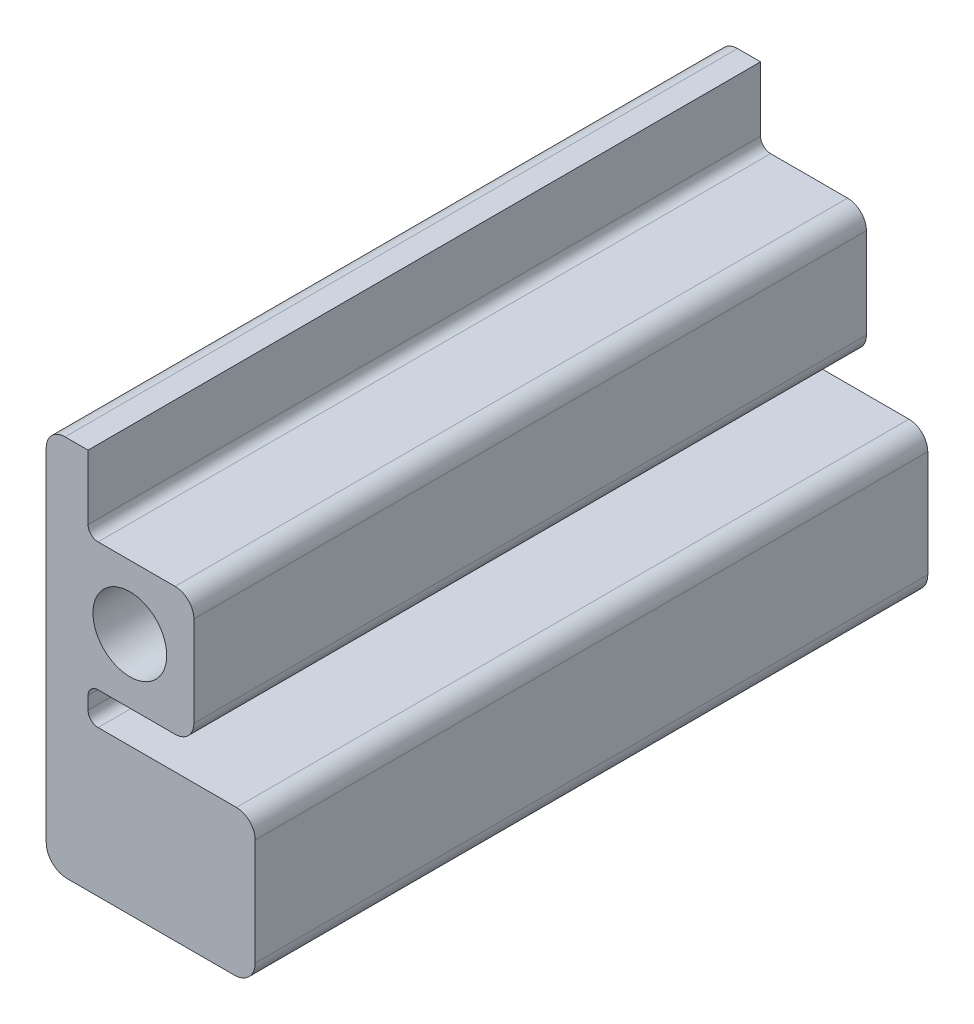
ISO-10303-21;
HEADER;
FILE_DESCRIPTION(('STEP AP214'),'2;1');
FILE_NAME('part.step','',(''),(''),'','','');
FILE_SCHEMA(('AUTOMOTIVE_DESIGN { 1 0 10303 214 1 1 1 1 }'));
ENDSEC;
DATA;
#1=APPLICATION_CONTEXT('core data for automotive mechanical design processes');
#2=APPLICATION_PROTOCOL_DEFINITION('international standard','automotive_design',2000,#1);
#3=PRODUCT_CONTEXT('',#1,'mechanical');
#4=PRODUCT('Part','Part','',(#3));
#5=PRODUCT_RELATED_PRODUCT_CATEGORY('part','',(#4));
#6=PRODUCT_DEFINITION_FORMATION('','',#4);
#7=PRODUCT_DEFINITION_CONTEXT('part definition',#1,'design');
#8=PRODUCT_DEFINITION('design','',#6,#7);
#9=PRODUCT_DEFINITION_SHAPE('','',#8);
#10=(LENGTH_UNIT() NAMED_UNIT(*) SI_UNIT(.MILLI.,.METRE.));
#11=(NAMED_UNIT(*) PLANE_ANGLE_UNIT() SI_UNIT($,.RADIAN.));
#12=(NAMED_UNIT(*) SI_UNIT($,.STERADIAN.) SOLID_ANGLE_UNIT());
#13=UNCERTAINTY_MEASURE_WITH_UNIT(LENGTH_MEASURE(1.E-05),#10,'distance_accuracy_value','');
#14=(GEOMETRIC_REPRESENTATION_CONTEXT(3) GLOBAL_UNCERTAINTY_ASSIGNED_CONTEXT((#13)) GLOBAL_UNIT_ASSIGNED_CONTEXT((#10,
#11,#12)) REPRESENTATION_CONTEXT('',''));
#15=CARTESIAN_POINT('',(0.,0.,0.));
#16=DIRECTION('',(0.,0.,1.));
#17=DIRECTION('',(1.,0.,0.));
#18=AXIS2_PLACEMENT_3D('',#15,#16,#17);
#19=CARTESIAN_POINT('',(-9.65199999999999,-22.503,204.313708212));
#20=DIRECTION('',(0.,0.,-1.));
#21=DIRECTION('',(-1.,0.,0.));
#22=AXIS2_PLACEMENT_3D('',#19,#20,#21);
#23=PLANE('',#22);
#24=CARTESIAN_POINT('',(0.,0.,204.313708212));
#25=DIRECTION('',(0.,0.,1.));
#26=DIRECTION('',(1.,0.,0.));
#27=AXIS2_PLACEMENT_3D('',#24,#25,#26);
#28=CIRCLE('',#27,11.2);
#29=CARTESIAN_POINT('',(11.2,0.,204.313708212));
#30=VERTEX_POINT('',#29);
#31=EDGE_CURVE('E220',#30,#30,#28,.T.);
#32=ORIENTED_EDGE('',*,*,#31,.F.);
#33=EDGE_LOOP('',(#32));
#34=FACE_BOUND('',#33,.T.);
#35=DIRECTION('',(0.,1.,0.));
#36=VECTOR('',#35,1.);
#37=CARTESIAN_POINT('',(-12.7,22.503,204.313708212));
#38=LINE('',#37,#36);
#39=CARTESIAN_POINT('',(-12.7,22.503,204.313708212));
#40=VERTEX_POINT('',#39);
#41=CARTESIAN_POINT('',(-12.7,42.08,204.313708212));
#42=VERTEX_POINT('',#41);
#43=EDGE_CURVE('E320',#40,#42,#38,.T.);
#44=ORIENTED_EDGE('',*,*,#43,.T.);
#45=DIRECTION('',(-1.,0.,0.));
#46=VECTOR('',#45,1.);
#47=CARTESIAN_POINT('',(32.385,42.08,204.313708212));
#48=LINE('',#47,#46);
#49=CARTESIAN_POINT('',(-19.685,42.08,204.313708212));
#50=VERTEX_POINT('',#49);
#51=EDGE_CURVE('E322',#42,#50,#48,.T.);
#52=ORIENTED_EDGE('',*,*,#51,.T.);
#53=CARTESIAN_POINT('',(-19.685,36.365,204.313708212));
#54=DIRECTION('',(0.,0.,1.));
#55=DIRECTION('',(1.,0.,0.));
#56=AXIS2_PLACEMENT_3D('',#53,#54,#55);
#57=CIRCLE('',#56,5.71499999999999);
#58=CARTESIAN_POINT('',(-25.4,36.365,204.313708212));
#59=VERTEX_POINT('',#58);
#60=EDGE_CURVE('E324',#50,#59,#57,.T.);
#61=ORIENTED_EDGE('',*,*,#60,.T.);
#62=DIRECTION('',(0.,-1.,0.));
#63=VECTOR('',#62,1.);
#64=CARTESIAN_POINT('',(-25.4,-67.479999962,204.313708212));
#65=LINE('',#64,#63);
#66=CARTESIAN_POINT('',(-25.4,-67.479999962,204.313708212));
#67=VERTEX_POINT('',#66);
#68=EDGE_CURVE('E326',#59,#67,#65,.T.);
#69=ORIENTED_EDGE('',*,*,#68,.T.);
#70=CARTESIAN_POINT('',(-19.05,-67.479999962,204.313708212));
#71=DIRECTION('',(0.,0.,1.));
#72=DIRECTION('',(-1.,0.,0.));
#73=AXIS2_PLACEMENT_3D('',#70,#71,#72);
#74=CIRCLE('',#73,6.35);
#75=CARTESIAN_POINT('',(-19.05,-73.829999962,204.313708212));
#76=VERTEX_POINT('',#75);
#77=EDGE_CURVE('E328',#67,#76,#74,.T.);
#78=ORIENTED_EDGE('',*,*,#77,.T.);
#79=DIRECTION('',(1.,0.,0.));
#80=VECTOR('',#79,1.);
#81=CARTESIAN_POINT('',(31.75,-73.829999962,204.313708212));
#82=LINE('',#81,#80);
#83=CARTESIAN_POINT('',(31.75,-73.829999962,204.313708212));
#84=VERTEX_POINT('',#83);
#85=EDGE_CURVE('E330',#76,#84,#82,.T.);
#86=ORIENTED_EDGE('',*,*,#85,.T.);
#87=CARTESIAN_POINT('',(31.75,-67.479999962,204.313708212));
#88=DIRECTION('',(0.,0.,1.));
#89=DIRECTION('',(1.,0.,0.));
#90=AXIS2_PLACEMENT_3D('',#87,#88,#89);
#91=CIRCLE('',#90,6.35);
#92=CARTESIAN_POINT('',(38.1,-67.479999962,204.313708212));
#93=VERTEX_POINT('',#92);
#94=EDGE_CURVE('E332',#84,#93,#91,.T.);
#95=ORIENTED_EDGE('',*,*,#94,.T.);
#96=DIRECTION('',(0.,1.,0.));
#97=VECTOR('',#96,1.);
#98=CARTESIAN_POINT('',(38.1,-67.479999962,204.313708212));
#99=LINE('',#98,#97);
#100=CARTESIAN_POINT('',(38.1,-35.094999962,204.313708212));
#101=VERTEX_POINT('',#100);
#102=EDGE_CURVE('E334',#93,#101,#99,.T.);
#103=ORIENTED_EDGE('',*,*,#102,.T.);
#104=CARTESIAN_POINT('',(32.385,-35.094999962,204.313708212));
#105=DIRECTION('',(0.,0.,1.));
#106=DIRECTION('',(1.,0.,0.));
#107=AXIS2_PLACEMENT_3D('',#104,#105,#106);
#108=CIRCLE('',#107,5.71499999999999);
#109=CARTESIAN_POINT('',(32.385,-29.379999962,204.313708212));
#110=VERTEX_POINT('',#109);
#111=EDGE_CURVE('E336',#101,#110,#108,.T.);
#112=ORIENTED_EDGE('',*,*,#111,.T.);
#113=DIRECTION('',(-1.,0.,0.));
#114=VECTOR('',#113,1.);
#115=CARTESIAN_POINT('',(32.385,-29.379999962,204.313708212));
#116=LINE('',#115,#114);
#117=CARTESIAN_POINT('',(-9.65199999999999,-29.379999962,204.313708212));
#118=VERTEX_POINT('',#117);
#119=EDGE_CURVE('E193',#110,#118,#116,.T.);
#120=ORIENTED_EDGE('',*,*,#119,.T.);
#121=CARTESIAN_POINT('',(-9.65199999999999,-26.331999962,204.313708212));
#122=DIRECTION('',(0.,0.,-1.));
#123=DIRECTION('',(-1.,0.,0.));
#124=AXIS2_PLACEMENT_3D('',#121,#122,#123);
#125=CIRCLE('',#124,3.048);
#126=CARTESIAN_POINT('',(-12.7,-26.331999962,204.313708212));
#127=VERTEX_POINT('',#126);
#128=EDGE_CURVE('E186',#118,#127,#125,.T.);
#129=ORIENTED_EDGE('',*,*,#128,.T.);
#130=DIRECTION('',(0.,1.,0.));
#131=VECTOR('',#130,1.);
#132=CARTESIAN_POINT('',(-12.7,-26.331999962,204.313708212));
#133=LINE('',#132,#131);
#134=CARTESIAN_POINT('',(-12.7,-22.503,204.313708212));
#135=VERTEX_POINT('',#134);
#136=EDGE_CURVE('E190',#127,#135,#133,.T.);
#137=ORIENTED_EDGE('',*,*,#136,.T.);
#138=CARTESIAN_POINT('',(-9.65199999999999,-22.503,204.313708212));
#139=DIRECTION('',(0.,0.,-1.));
#140=DIRECTION('',(-1.,0.,0.));
#141=AXIS2_PLACEMENT_3D('',#138,#139,#140);
#142=CIRCLE('',#141,3.048);
#143=CARTESIAN_POINT('',(-9.65199999999999,-19.455,204.313708212));
#144=VERTEX_POINT('',#143);
#145=EDGE_CURVE('E210',#135,#144,#142,.T.);
#146=ORIENTED_EDGE('',*,*,#145,.T.);
#147=DIRECTION('',(1.,0.,0.));
#148=VECTOR('',#147,1.);
#149=CARTESIAN_POINT('',(13.74,-19.455,204.313708212));
#150=LINE('',#149,#148);
#151=CARTESIAN_POINT('',(13.74,-19.455,204.313708212));
#152=VERTEX_POINT('',#151);
#153=EDGE_CURVE('E68',#144,#152,#150,.T.);
#154=ORIENTED_EDGE('',*,*,#153,.T.);
#155=CARTESIAN_POINT('',(13.74,-13.74,204.313708212));
#156=DIRECTION('',(0.,0.,1.));
#157=DIRECTION('',(-1.,0.,0.));
#158=AXIS2_PLACEMENT_3D('',#155,#156,#157);
#159=CIRCLE('',#158,5.715);
#160=CARTESIAN_POINT('',(19.455,-13.74,204.313708212));
#161=VERTEX_POINT('',#160);
#162=EDGE_CURVE('E141',#152,#161,#159,.T.);
#163=ORIENTED_EDGE('',*,*,#162,.T.);
#164=DIRECTION('',(0.,1.,0.));
#165=VECTOR('',#164,1.);
#166=CARTESIAN_POINT('',(19.455,0.,204.313708212));
#167=LINE('',#166,#165);
#168=CARTESIAN_POINT('',(19.455,13.74,204.313708212));
#169=VERTEX_POINT('',#168);
#170=EDGE_CURVE('E312',#161,#169,#167,.T.);
#171=ORIENTED_EDGE('',*,*,#170,.T.);
#172=CARTESIAN_POINT('',(13.74,13.74,204.313708212));
#173=DIRECTION('',(0.,0.,1.));
#174=DIRECTION('',(-1.,0.,0.));
#175=AXIS2_PLACEMENT_3D('',#172,#173,#174);
#176=CIRCLE('',#175,5.715);
#177=CARTESIAN_POINT('',(13.74,19.455,204.313708212));
#178=VERTEX_POINT('',#177);
#179=EDGE_CURVE('E309',#169,#178,#176,.T.);
#180=ORIENTED_EDGE('',*,*,#179,.T.);
#181=DIRECTION('',(-1.,0.,0.));
#182=VECTOR('',#181,1.);
#183=CARTESIAN_POINT('',(0.,19.455,204.313708212));
#184=LINE('',#183,#182);
#185=CARTESIAN_POINT('',(-9.65199999999999,19.455,204.313708212));
#186=VERTEX_POINT('',#185);
#187=EDGE_CURVE('E311',#178,#186,#184,.T.);
#188=ORIENTED_EDGE('',*,*,#187,.T.);
#189=CARTESIAN_POINT('',(-9.65199999999999,22.503,204.313708212));
#190=DIRECTION('',(0.,0.,-1.));
#191=DIRECTION('',(-1.,0.,0.));
#192=AXIS2_PLACEMENT_3D('',#189,#190,#191);
#193=CIRCLE('',#192,3.048);
#194=EDGE_CURVE('E314',#186,#40,#193,.T.);
#195=ORIENTED_EDGE('',*,*,#194,.T.);
#196=EDGE_LOOP('',(#44,#52,#61,#69,#78,#86,#95,#103,#112,#120,#129,#137,#146,#154,#163,#171,
#180,#188,#195));
#197=FACE_BOUND('',#196,.T.);
#198=ADVANCED_FACE('F45',(#34,#197),#23,.F.);
#199=CARTESIAN_POINT('',(-9.65199999999999,-22.503,0.));
#200=DIRECTION('',(0.,0.,-1.));
#201=DIRECTION('',(-1.,0.,0.));
#202=AXIS2_PLACEMENT_3D('',#199,#200,#201);
#203=PLANE('',#202);
#204=CARTESIAN_POINT('',(0.,0.,0.));
#205=DIRECTION('',(0.,0.,1.));
#206=DIRECTION('',(1.,0.,0.));
#207=AXIS2_PLACEMENT_3D('',#204,#205,#206);
#208=CIRCLE('',#207,11.2);
#209=CARTESIAN_POINT('',(11.2,0.,0.));
#210=VERTEX_POINT('',#209);
#211=EDGE_CURVE('E350',#210,#210,#208,.T.);
#212=ORIENTED_EDGE('',*,*,#211,.T.);
#213=EDGE_LOOP('',(#212));
#214=FACE_BOUND('',#213,.T.);
#215=DIRECTION('',(-1.,0.,0.));
#216=VECTOR('',#215,1.);
#217=CARTESIAN_POINT('',(32.385,42.08,0.));
#218=LINE('',#217,#216);
#219=CARTESIAN_POINT('',(-12.7,42.08,0.));
#220=VERTEX_POINT('',#219);
#221=CARTESIAN_POINT('',(-19.685,42.08,0.));
#222=VERTEX_POINT('',#221);
#223=EDGE_CURVE('E230',#220,#222,#218,.T.);
#224=ORIENTED_EDGE('',*,*,#223,.F.);
#225=DIRECTION('',(0.,1.,0.));
#226=VECTOR('',#225,1.);
#227=CARTESIAN_POINT('',(-12.7,22.503,0.));
#228=LINE('',#227,#226);
#229=CARTESIAN_POINT('',(-12.7,22.503,0.));
#230=VERTEX_POINT('',#229);
#231=EDGE_CURVE('E59',#230,#220,#228,.T.);
#232=ORIENTED_EDGE('',*,*,#231,.F.);
#233=CARTESIAN_POINT('',(-9.65199999999999,22.503,0.));
#234=DIRECTION('',(0.,0.,-1.));
#235=DIRECTION('',(-1.,0.,0.));
#236=AXIS2_PLACEMENT_3D('',#233,#234,#235);
#237=CIRCLE('',#236,3.048);
#238=CARTESIAN_POINT('',(-9.65199999999999,19.455,0.));
#239=VERTEX_POINT('',#238);
#240=EDGE_CURVE('E227',#239,#230,#237,.T.);
#241=ORIENTED_EDGE('',*,*,#240,.F.);
#242=DIRECTION('',(-1.,0.,0.));
#243=VECTOR('',#242,1.);
#244=CARTESIAN_POINT('',(-9.65199999999999,19.455,0.));
#245=LINE('',#244,#243);
#246=CARTESIAN_POINT('',(13.74,19.455,0.));
#247=VERTEX_POINT('',#246);
#248=EDGE_CURVE('E225',#247,#239,#245,.T.);
#249=ORIENTED_EDGE('',*,*,#248,.F.);
#250=CARTESIAN_POINT('',(13.74,13.74,0.));
#251=DIRECTION('',(0.,0.,1.));
#252=DIRECTION('',(-1.,0.,0.));
#253=AXIS2_PLACEMENT_3D('',#250,#251,#252);
#254=CIRCLE('',#253,5.715);
#255=CARTESIAN_POINT('',(19.455,13.74,0.));
#256=VERTEX_POINT('',#255);
#257=EDGE_CURVE('E222',#256,#247,#254,.T.);
#258=ORIENTED_EDGE('',*,*,#257,.F.);
#259=DIRECTION('',(0.,1.,0.));
#260=VECTOR('',#259,1.);
#261=CARTESIAN_POINT('',(19.455,13.74,0.));
#262=LINE('',#261,#260);
#263=CARTESIAN_POINT('',(19.455,-13.74,0.));
#264=VERTEX_POINT('',#263);
#265=EDGE_CURVE('E219',#264,#256,#262,.T.);
#266=ORIENTED_EDGE('',*,*,#265,.F.);
#267=CARTESIAN_POINT('',(13.74,-13.74,0.));
#268=DIRECTION('',(0.,0.,1.));
#269=DIRECTION('',(-1.,0.,0.));
#270=AXIS2_PLACEMENT_3D('',#267,#268,#269);
#271=CIRCLE('',#270,5.715);
#272=CARTESIAN_POINT('',(13.74,-19.455,0.));
#273=VERTEX_POINT('',#272);
#274=EDGE_CURVE('E216',#273,#264,#271,.T.);
#275=ORIENTED_EDGE('',*,*,#274,.F.);
#276=DIRECTION('',(1.,0.,0.));
#277=VECTOR('',#276,1.);
#278=CARTESIAN_POINT('',(-9.65199999999999,-19.455,0.));
#279=LINE('',#278,#277);
#280=CARTESIAN_POINT('',(-9.65199999999999,-19.455,0.));
#281=VERTEX_POINT('',#280);
#282=EDGE_CURVE('E252',#281,#273,#279,.T.);
#283=ORIENTED_EDGE('',*,*,#282,.F.);
#284=CARTESIAN_POINT('',(-9.65199999999999,-22.503,0.));
#285=DIRECTION('',(0.,0.,-1.));
#286=DIRECTION('',(-1.,0.,0.));
#287=AXIS2_PLACEMENT_3D('',#284,#285,#286);
#288=CIRCLE('',#287,3.048);
#289=CARTESIAN_POINT('',(-12.7,-22.503,0.));
#290=VERTEX_POINT('',#289);
#291=EDGE_CURVE('E133',#290,#281,#288,.T.);
#292=ORIENTED_EDGE('',*,*,#291,.F.);
#293=DIRECTION('',(0.,1.,0.));
#294=VECTOR('',#293,1.);
#295=CARTESIAN_POINT('',(-12.7,-26.331999962,0.));
#296=LINE('',#295,#294);
#297=CARTESIAN_POINT('',(-12.7,-26.331999962,0.));
#298=VERTEX_POINT('',#297);
#299=EDGE_CURVE('E249',#298,#290,#296,.T.);
#300=ORIENTED_EDGE('',*,*,#299,.F.);
#301=CARTESIAN_POINT('',(-9.65199999999999,-26.331999962,0.));
#302=DIRECTION('',(0.,0.,-1.));
#303=DIRECTION('',(-1.,0.,0.));
#304=AXIS2_PLACEMENT_3D('',#301,#302,#303);
#305=CIRCLE('',#304,3.048);
#306=CARTESIAN_POINT('',(-9.65199999999999,-29.379999962,0.));
#307=VERTEX_POINT('',#306);
#308=EDGE_CURVE('E202',#307,#298,#305,.T.);
#309=ORIENTED_EDGE('',*,*,#308,.F.);
#310=DIRECTION('',(-1.,0.,0.));
#311=VECTOR('',#310,1.);
#312=CARTESIAN_POINT('',(32.385,-29.379999962,0.));
#313=LINE('',#312,#311);
#314=CARTESIAN_POINT('',(32.385,-29.379999962,0.));
#315=VERTEX_POINT('',#314);
#316=EDGE_CURVE('E246',#315,#307,#313,.T.);
#317=ORIENTED_EDGE('',*,*,#316,.F.);
#318=CARTESIAN_POINT('',(32.385,-35.094999962,0.));
#319=DIRECTION('',(0.,0.,1.));
#320=DIRECTION('',(1.,0.,0.));
#321=AXIS2_PLACEMENT_3D('',#318,#319,#320);
#322=CIRCLE('',#321,5.71499999999999);
#323=CARTESIAN_POINT('',(38.1,-35.094999962,0.));
#324=VERTEX_POINT('',#323);
#325=EDGE_CURVE('E244',#324,#315,#322,.T.);
#326=ORIENTED_EDGE('',*,*,#325,.F.);
#327=DIRECTION('',(0.,1.,0.));
#328=VECTOR('',#327,1.);
#329=CARTESIAN_POINT('',(38.1,-67.479999962,0.));
#330=LINE('',#329,#328);
#331=CARTESIAN_POINT('',(38.1,-67.479999962,0.));
#332=VERTEX_POINT('',#331);
#333=EDGE_CURVE('E242',#332,#324,#330,.T.);
#334=ORIENTED_EDGE('',*,*,#333,.F.);
#335=CARTESIAN_POINT('',(31.75,-67.479999962,0.));
#336=DIRECTION('',(0.,0.,1.));
#337=DIRECTION('',(1.,0.,0.));
#338=AXIS2_PLACEMENT_3D('',#335,#336,#337);
#339=CIRCLE('',#338,6.35);
#340=CARTESIAN_POINT('',(31.75,-73.829999962,0.));
#341=VERTEX_POINT('',#340);
#342=EDGE_CURVE('E240',#341,#332,#339,.T.);
#343=ORIENTED_EDGE('',*,*,#342,.F.);
#344=DIRECTION('',(1.,0.,0.));
#345=VECTOR('',#344,1.);
#346=CARTESIAN_POINT('',(31.75,-73.829999962,0.));
#347=LINE('',#346,#345);
#348=CARTESIAN_POINT('',(-19.05,-73.829999962,0.));
#349=VERTEX_POINT('',#348);
#350=EDGE_CURVE('E238',#349,#341,#347,.T.);
#351=ORIENTED_EDGE('',*,*,#350,.F.);
#352=CARTESIAN_POINT('',(-19.05,-67.479999962,0.));
#353=DIRECTION('',(0.,0.,1.));
#354=DIRECTION('',(-1.,0.,0.));
#355=AXIS2_PLACEMENT_3D('',#352,#353,#354);
#356=CIRCLE('',#355,6.35);
#357=CARTESIAN_POINT('',(-25.4,-67.479999962,0.));
#358=VERTEX_POINT('',#357);
#359=EDGE_CURVE('E236',#358,#349,#356,.T.);
#360=ORIENTED_EDGE('',*,*,#359,.F.);
#361=DIRECTION('',(0.,-1.,0.));
#362=VECTOR('',#361,1.);
#363=CARTESIAN_POINT('',(-25.4,-67.479999962,0.));
#364=LINE('',#363,#362);
#365=CARTESIAN_POINT('',(-25.4,36.365,0.));
#366=VERTEX_POINT('',#365);
#367=EDGE_CURVE('E234',#366,#358,#364,.T.);
#368=ORIENTED_EDGE('',*,*,#367,.F.);
#369=CARTESIAN_POINT('',(-19.685,36.365,0.));
#370=DIRECTION('',(0.,0.,1.));
#371=DIRECTION('',(1.,0.,0.));
#372=AXIS2_PLACEMENT_3D('',#369,#370,#371);
#373=CIRCLE('',#372,5.71499999999999);
#374=EDGE_CURVE('E232',#222,#366,#373,.T.);
#375=ORIENTED_EDGE('',*,*,#374,.F.);
#376=EDGE_LOOP('',(#224,#232,#241,#249,#258,#266,#275,#283,#292,#300,#309,#317,#326,#334,#343,
#351,#360,#368,#375));
#377=FACE_BOUND('',#376,.T.);
#378=ADVANCED_FACE('F299',(#214,#377),#203,.T.);
#379=CARTESIAN_POINT('',(32.385,42.08,204.313708212));
#380=DIRECTION('',(0.,-1.,0.));
#381=DIRECTION('',(1.,0.,0.));
#382=AXIS2_PLACEMENT_3D('',#379,#380,#381);
#383=PLANE('',#382);
#384=DIRECTION('',(0.,0.,1.));
#385=VECTOR('',#384,1.);
#386=CARTESIAN_POINT('',(-12.7,42.08,204.313708212));
#387=LINE('',#386,#385);
#388=EDGE_CURVE('E11',#220,#42,#387,.T.);
#389=ORIENTED_EDGE('',*,*,#388,.F.);
#390=ORIENTED_EDGE('',*,*,#223,.T.);
#391=DIRECTION('',(0.,0.,-1.));
#392=VECTOR('',#391,1.);
#393=CARTESIAN_POINT('',(-19.685,42.08,204.313708212));
#394=LINE('',#393,#392);
#395=EDGE_CURVE('E278',#50,#222,#394,.T.);
#396=ORIENTED_EDGE('',*,*,#395,.F.);
#397=ORIENTED_EDGE('',*,*,#51,.F.);
#398=EDGE_LOOP('',(#389,#390,#396,#397));
#399=FACE_BOUND('',#398,.T.);
#400=ADVANCED_FACE('F365',(#399),#383,.F.);
#401=CARTESIAN_POINT('',(13.74,-13.74,204.313708212));
#402=DIRECTION('',(0.,0.,-1.));
#403=DIRECTION('',(-1.,0.,0.));
#404=AXIS2_PLACEMENT_3D('',#401,#402,#403);
#405=CYLINDRICAL_SURFACE('',#404,5.715);
#406=ORIENTED_EDGE('',*,*,#274,.T.);
#407=DIRECTION('',(0.,0.,-1.));
#408=VECTOR('',#407,1.);
#409=CARTESIAN_POINT('',(19.455,-13.74,204.313708212));
#410=LINE('',#409,#408);
#411=EDGE_CURVE('E292',#161,#264,#410,.T.);
#412=ORIENTED_EDGE('',*,*,#411,.F.);
#413=ORIENTED_EDGE('',*,*,#162,.F.);
#414=DIRECTION('',(0.,0.,-1.));
#415=VECTOR('',#414,1.);
#416=CARTESIAN_POINT('',(13.74,-19.455,204.313708212));
#417=LINE('',#416,#415);
#418=EDGE_CURVE('E53',#152,#273,#417,.T.);
#419=ORIENTED_EDGE('',*,*,#418,.T.);
#420=EDGE_LOOP('',(#406,#412,#413,#419));
#421=FACE_BOUND('',#420,.T.);
#422=ADVANCED_FACE('F47',(#421),#405,.T.);
#423=CARTESIAN_POINT('',(19.455,13.74,204.313708212));
#424=DIRECTION('',(-1.,0.,0.));
#425=DIRECTION('',(0.,0.,1.));
#426=AXIS2_PLACEMENT_3D('',#423,#424,#425);
#427=PLANE('',#426);
#428=ORIENTED_EDGE('',*,*,#265,.T.);
#429=DIRECTION('',(0.,0.,-1.));
#430=VECTOR('',#429,1.);
#431=CARTESIAN_POINT('',(19.455,13.74,204.313708212));
#432=LINE('',#431,#430);
#433=EDGE_CURVE('E289',#169,#256,#432,.T.);
#434=ORIENTED_EDGE('',*,*,#433,.F.);
#435=ORIENTED_EDGE('',*,*,#170,.F.);
#436=ORIENTED_EDGE('',*,*,#411,.T.);
#437=EDGE_LOOP('',(#428,#434,#435,#436));
#438=FACE_BOUND('',#437,.T.);
#439=ADVANCED_FACE('F303',(#438),#427,.F.);
#440=CARTESIAN_POINT('',(13.74,13.74,204.313708212));
#441=DIRECTION('',(0.,0.,-1.));
#442=DIRECTION('',(-1.,0.,0.));
#443=AXIS2_PLACEMENT_3D('',#440,#441,#442);
#444=CYLINDRICAL_SURFACE('',#443,5.715);
#445=ORIENTED_EDGE('',*,*,#257,.T.);
#446=DIRECTION('',(0.,0.,-1.));
#447=VECTOR('',#446,1.);
#448=CARTESIAN_POINT('',(13.74,19.455,204.313708212));
#449=LINE('',#448,#447);
#450=EDGE_CURVE('E286',#178,#247,#449,.T.);
#451=ORIENTED_EDGE('',*,*,#450,.F.);
#452=ORIENTED_EDGE('',*,*,#179,.F.);
#453=ORIENTED_EDGE('',*,*,#433,.T.);
#454=EDGE_LOOP('',(#445,#451,#452,#453));
#455=FACE_BOUND('',#454,.T.);
#456=ADVANCED_FACE('F307',(#455),#444,.T.);
#457=CARTESIAN_POINT('',(-9.65199999999999,19.455,204.313708212));
#458=DIRECTION('',(0.,-1.,0.));
#459=DIRECTION('',(1.,0.,0.));
#460=AXIS2_PLACEMENT_3D('',#457,#458,#459);
#461=PLANE('',#460);
#462=ORIENTED_EDGE('',*,*,#248,.T.);
#463=DIRECTION('',(0.,0.,-1.));
#464=VECTOR('',#463,1.);
#465=CARTESIAN_POINT('',(-9.65199999999999,19.455,204.313708212));
#466=LINE('',#465,#464);
#467=EDGE_CURVE('E283',#186,#239,#466,.T.);
#468=ORIENTED_EDGE('',*,*,#467,.F.);
#469=ORIENTED_EDGE('',*,*,#187,.F.);
#470=ORIENTED_EDGE('',*,*,#450,.T.);
#471=EDGE_LOOP('',(#462,#468,#469,#470));
#472=FACE_BOUND('',#471,.T.);
#473=ADVANCED_FACE('F415',(#472),#461,.F.);
#474=CARTESIAN_POINT('',(-9.65199999999999,22.503,204.313708212));
#475=DIRECTION('',(0.,0.,-1.));
#476=DIRECTION('',(-1.,0.,0.));
#477=AXIS2_PLACEMENT_3D('',#474,#475,#476);
#478=CYLINDRICAL_SURFACE('',#477,3.048);
#479=ORIENTED_EDGE('',*,*,#240,.T.);
#480=DIRECTION('',(0.,0.,-1.));
#481=VECTOR('',#480,1.);
#482=CARTESIAN_POINT('',(-12.7,22.503,204.313708212));
#483=LINE('',#482,#481);
#484=EDGE_CURVE('E281',#40,#230,#483,.T.);
#485=ORIENTED_EDGE('',*,*,#484,.F.);
#486=ORIENTED_EDGE('',*,*,#194,.F.);
#487=ORIENTED_EDGE('',*,*,#467,.T.);
#488=EDGE_LOOP('',(#479,#485,#486,#487));
#489=FACE_BOUND('',#488,.T.);
#490=ADVANCED_FACE('F412',(#489),#478,.F.);
#491=CARTESIAN_POINT('',(-12.7,22.503,204.313708212));
#492=DIRECTION('',(-1.,0.,0.));
#493=DIRECTION('',(0.,0.,1.));
#494=AXIS2_PLACEMENT_3D('',#491,#492,#493);
#495=PLANE('',#494);
#496=ORIENTED_EDGE('',*,*,#231,.T.);
#497=ORIENTED_EDGE('',*,*,#388,.T.);
#498=ORIENTED_EDGE('',*,*,#43,.F.);
#499=ORIENTED_EDGE('',*,*,#484,.T.);
#500=EDGE_LOOP('',(#496,#497,#498,#499));
#501=FACE_BOUND('',#500,.T.);
#502=ADVANCED_FACE('F405',(#501),#495,.F.);
#503=CARTESIAN_POINT('',(-19.685,36.365,204.313708212));
#504=DIRECTION('',(0.,0.,-1.));
#505=DIRECTION('',(-1.,0.,0.));
#506=AXIS2_PLACEMENT_3D('',#503,#504,#505);
#507=CYLINDRICAL_SURFACE('',#506,5.71499999999999);
#508=ORIENTED_EDGE('',*,*,#374,.T.);
#509=DIRECTION('',(0.,0.,-1.));
#510=VECTOR('',#509,1.);
#511=CARTESIAN_POINT('',(-25.4,36.365,204.313708212));
#512=LINE('',#511,#510);
#513=EDGE_CURVE('E275',#59,#366,#512,.T.);
#514=ORIENTED_EDGE('',*,*,#513,.F.);
#515=ORIENTED_EDGE('',*,*,#60,.F.);
#516=ORIENTED_EDGE('',*,*,#395,.T.);
#517=EDGE_LOOP('',(#508,#514,#515,#516));
#518=FACE_BOUND('',#517,.T.);
#519=ADVANCED_FACE('F401',(#518),#507,.T.);
#520=CARTESIAN_POINT('',(-25.4,-67.479999962,204.313708212));
#521=DIRECTION('',(1.,0.,0.));
#522=DIRECTION('',(0.,1.,0.));
#523=AXIS2_PLACEMENT_3D('',#520,#521,#522);
#524=PLANE('',#523);
#525=ORIENTED_EDGE('',*,*,#367,.T.);
#526=DIRECTION('',(0.,0.,-1.));
#527=VECTOR('',#526,1.);
#528=CARTESIAN_POINT('',(-25.4,-67.479999962,204.313708212));
#529=LINE('',#528,#527);
#530=EDGE_CURVE('E272',#67,#358,#529,.T.);
#531=ORIENTED_EDGE('',*,*,#530,.F.);
#532=ORIENTED_EDGE('',*,*,#68,.F.);
#533=ORIENTED_EDGE('',*,*,#513,.T.);
#534=EDGE_LOOP('',(#525,#531,#532,#533));
#535=FACE_BOUND('',#534,.T.);
#536=ADVANCED_FACE('F397',(#535),#524,.F.);
#537=CARTESIAN_POINT('',(-19.05,-67.479999962,204.313708212));
#538=DIRECTION('',(0.,0.,-1.));
#539=DIRECTION('',(-1.,0.,0.));
#540=AXIS2_PLACEMENT_3D('',#537,#538,#539);
#541=CYLINDRICAL_SURFACE('',#540,6.35);
#542=ORIENTED_EDGE('',*,*,#359,.T.);
#543=DIRECTION('',(0.,0.,-1.));
#544=VECTOR('',#543,1.);
#545=CARTESIAN_POINT('',(-19.05,-73.829999962,204.313708212));
#546=LINE('',#545,#544);
#547=EDGE_CURVE('E269',#76,#349,#546,.T.);
#548=ORIENTED_EDGE('',*,*,#547,.F.);
#549=ORIENTED_EDGE('',*,*,#77,.F.);
#550=ORIENTED_EDGE('',*,*,#530,.T.);
#551=EDGE_LOOP('',(#542,#548,#549,#550));
#552=FACE_BOUND('',#551,.T.);
#553=ADVANCED_FACE('F393',(#552),#541,.T.);
#554=CARTESIAN_POINT('',(31.75,-73.829999962,204.313708212));
#555=DIRECTION('',(0.,1.,0.));
#556=DIRECTION('',(0.,0.,1.));
#557=AXIS2_PLACEMENT_3D('',#554,#555,#556);
#558=PLANE('',#557);
#559=ORIENTED_EDGE('',*,*,#350,.T.);
#560=DIRECTION('',(0.,0.,-1.));
#561=VECTOR('',#560,1.);
#562=CARTESIAN_POINT('',(31.75,-73.829999962,204.313708212));
#563=LINE('',#562,#561);
#564=EDGE_CURVE('E266',#84,#341,#563,.T.);
#565=ORIENTED_EDGE('',*,*,#564,.F.);
#566=ORIENTED_EDGE('',*,*,#85,.F.);
#567=ORIENTED_EDGE('',*,*,#547,.T.);
#568=EDGE_LOOP('',(#559,#565,#566,#567));
#569=FACE_BOUND('',#568,.T.);
#570=ADVANCED_FACE('F389',(#569),#558,.F.);
#571=CARTESIAN_POINT('',(31.75,-67.479999962,204.313708212));
#572=DIRECTION('',(0.,0.,-1.));
#573=DIRECTION('',(-1.,0.,0.));
#574=AXIS2_PLACEMENT_3D('',#571,#572,#573);
#575=CYLINDRICAL_SURFACE('',#574,6.35);
#576=ORIENTED_EDGE('',*,*,#342,.T.);
#577=DIRECTION('',(0.,0.,-1.));
#578=VECTOR('',#577,1.);
#579=CARTESIAN_POINT('',(38.1,-67.479999962,204.313708212));
#580=LINE('',#579,#578);
#581=EDGE_CURVE('E263',#93,#332,#580,.T.);
#582=ORIENTED_EDGE('',*,*,#581,.F.);
#583=ORIENTED_EDGE('',*,*,#94,.F.);
#584=ORIENTED_EDGE('',*,*,#564,.T.);
#585=EDGE_LOOP('',(#576,#582,#583,#584));
#586=FACE_BOUND('',#585,.T.);
#587=ADVANCED_FACE('F385',(#586),#575,.T.);
#588=CARTESIAN_POINT('',(38.1,-67.479999962,204.313708212));
#589=DIRECTION('',(-1.,0.,0.));
#590=DIRECTION('',(0.,-1.,0.));
#591=AXIS2_PLACEMENT_3D('',#588,#589,#590);
#592=PLANE('',#591);
#593=ORIENTED_EDGE('',*,*,#333,.T.);
#594=DIRECTION('',(0.,0.,-1.));
#595=VECTOR('',#594,1.);
#596=CARTESIAN_POINT('',(38.1,-35.094999962,204.313708212));
#597=LINE('',#596,#595);
#598=EDGE_CURVE('E260',#101,#324,#597,.T.);
#599=ORIENTED_EDGE('',*,*,#598,.F.);
#600=ORIENTED_EDGE('',*,*,#102,.F.);
#601=ORIENTED_EDGE('',*,*,#581,.T.);
#602=EDGE_LOOP('',(#593,#599,#600,#601));
#603=FACE_BOUND('',#602,.T.);
#604=ADVANCED_FACE('F382',(#603),#592,.F.);
#605=CARTESIAN_POINT('',(32.385,-35.094999962,204.313708212));
#606=DIRECTION('',(0.,0.,-1.));
#607=DIRECTION('',(-1.,0.,0.));
#608=AXIS2_PLACEMENT_3D('',#605,#606,#607);
#609=CYLINDRICAL_SURFACE('',#608,5.71499999999999);
#610=ORIENTED_EDGE('',*,*,#325,.T.);
#611=DIRECTION('',(0.,0.,-1.));
#612=VECTOR('',#611,1.);
#613=CARTESIAN_POINT('',(32.385,-29.379999962,204.313708212));
#614=LINE('',#613,#612);
#615=EDGE_CURVE('E257',#110,#315,#614,.T.);
#616=ORIENTED_EDGE('',*,*,#615,.F.);
#617=ORIENTED_EDGE('',*,*,#111,.F.);
#618=ORIENTED_EDGE('',*,*,#598,.T.);
#619=EDGE_LOOP('',(#610,#616,#617,#618));
#620=FACE_BOUND('',#619,.T.);
#621=ADVANCED_FACE('F342',(#620),#609,.T.);
#622=CARTESIAN_POINT('',(32.385,-29.379999962,204.313708212));
#623=DIRECTION('',(0.,-1.,0.));
#624=DIRECTION('',(1.,0.,0.));
#625=AXIS2_PLACEMENT_3D('',#622,#623,#624);
#626=PLANE('',#625);
#627=ORIENTED_EDGE('',*,*,#316,.T.);
#628=DIRECTION('',(0.,0.,-1.));
#629=VECTOR('',#628,1.);
#630=CARTESIAN_POINT('',(-9.65199999999999,-29.379999962,204.313708212));
#631=LINE('',#630,#629);
#632=EDGE_CURVE('E205',#118,#307,#631,.T.);
#633=ORIENTED_EDGE('',*,*,#632,.F.);
#634=ORIENTED_EDGE('',*,*,#119,.F.);
#635=ORIENTED_EDGE('',*,*,#615,.T.);
#636=EDGE_LOOP('',(#627,#633,#634,#635));
#637=FACE_BOUND('',#636,.T.);
#638=ADVANCED_FACE('F346',(#637),#626,.F.);
#639=CARTESIAN_POINT('',(-9.65199999999999,-26.331999962,204.313708212));
#640=DIRECTION('',(0.,0.,-1.));
#641=DIRECTION('',(-1.,0.,0.));
#642=AXIS2_PLACEMENT_3D('',#639,#640,#641);
#643=CYLINDRICAL_SURFACE('',#642,3.048);
#644=ORIENTED_EDGE('',*,*,#308,.T.);
#645=DIRECTION('',(0.,0.,-1.));
#646=VECTOR('',#645,1.);
#647=CARTESIAN_POINT('',(-12.7,-26.331999962,204.313708212));
#648=LINE('',#647,#646);
#649=EDGE_CURVE('E199',#127,#298,#648,.T.);
#650=ORIENTED_EDGE('',*,*,#649,.F.);
#651=ORIENTED_EDGE('',*,*,#128,.F.);
#652=ORIENTED_EDGE('',*,*,#632,.T.);
#653=EDGE_LOOP('',(#644,#650,#651,#652));
#654=FACE_BOUND('',#653,.T.);
#655=ADVANCED_FACE('F200',(#654),#643,.F.);
#656=CARTESIAN_POINT('',(-12.7,-26.331999962,204.313708212));
#657=DIRECTION('',(-1.,0.,0.));
#658=DIRECTION('',(0.,0.,1.));
#659=AXIS2_PLACEMENT_3D('',#656,#657,#658);
#660=PLANE('',#659);
#661=ORIENTED_EDGE('',*,*,#299,.T.);
#662=DIRECTION('',(0.,0.,-1.));
#663=VECTOR('',#662,1.);
#664=CARTESIAN_POINT('',(-12.7,-22.503,204.313708212));
#665=LINE('',#664,#663);
#666=EDGE_CURVE('E206',#135,#290,#665,.T.);
#667=ORIENTED_EDGE('',*,*,#666,.F.);
#668=ORIENTED_EDGE('',*,*,#136,.F.);
#669=ORIENTED_EDGE('',*,*,#649,.T.);
#670=EDGE_LOOP('',(#661,#667,#668,#669));
#671=FACE_BOUND('',#670,.T.);
#672=ADVANCED_FACE('F208',(#671),#660,.F.);
#673=CARTESIAN_POINT('',(-9.65199999999999,-22.503,204.313708212));
#674=DIRECTION('',(0.,0.,-1.));
#675=DIRECTION('',(-1.,0.,0.));
#676=AXIS2_PLACEMENT_3D('',#673,#674,#675);
#677=CYLINDRICAL_SURFACE('',#676,3.048);
#678=ORIENTED_EDGE('',*,*,#291,.T.);
#679=DIRECTION('',(0.,0.,-1.));
#680=VECTOR('',#679,1.);
#681=CARTESIAN_POINT('',(-9.65199999999999,-19.455,204.313708212));
#682=LINE('',#681,#680);
#683=EDGE_CURVE('E212',#144,#281,#682,.T.);
#684=ORIENTED_EDGE('',*,*,#683,.F.);
#685=ORIENTED_EDGE('',*,*,#145,.F.);
#686=ORIENTED_EDGE('',*,*,#666,.T.);
#687=EDGE_LOOP('',(#678,#684,#685,#686));
#688=FACE_BOUND('',#687,.T.);
#689=ADVANCED_FACE('F347',(#688),#677,.F.);
#690=CARTESIAN_POINT('',(-9.65199999999999,-19.455,204.313708212));
#691=DIRECTION('',(0.,1.,0.));
#692=DIRECTION('',(-1.,0.,0.));
#693=AXIS2_PLACEMENT_3D('',#690,#691,#692);
#694=PLANE('',#693);
#695=ORIENTED_EDGE('',*,*,#282,.T.);
#696=ORIENTED_EDGE('',*,*,#418,.F.);
#697=ORIENTED_EDGE('',*,*,#153,.F.);
#698=ORIENTED_EDGE('',*,*,#683,.T.);
#699=EDGE_LOOP('',(#695,#696,#697,#698));
#700=FACE_BOUND('',#699,.T.);
#701=ADVANCED_FACE('F295',(#700),#694,.F.);
#702=CARTESIAN_POINT('',(0.,0.,204.313708212));
#703=DIRECTION('',(0.,0.,-1.));
#704=DIRECTION('',(-1.,0.,0.));
#705=AXIS2_PLACEMENT_3D('',#702,#703,#704);
#706=CYLINDRICAL_SURFACE('',#705,11.2);
#707=ORIENTED_EDGE('',*,*,#31,.T.);
#708=EDGE_LOOP('',(#707));
#709=FACE_BOUND('',#708,.T.);
#710=ORIENTED_EDGE('',*,*,#211,.F.);
#711=EDGE_LOOP('',(#710));
#712=FACE_BOUND('',#711,.T.);
#713=ADVANCED_FACE('F356',(#709,#712),#706,.F.);
#714=CLOSED_SHELL('',(#198,#378,#400,#422,#439,#456,#473,#490,#502,#519,#536,#553,#570,#587,
#604,#621,#638,#655,#672,#689,#701,#713));
#715=MANIFOLD_SOLID_BREP('B2',#714);
#716=ADVANCED_BREP_SHAPE_REPRESENTATION('',(#18,#715),#14);
#717=SHAPE_DEFINITION_REPRESENTATION(#9,#716);
ENDSEC;
END-ISO-10303-21;
